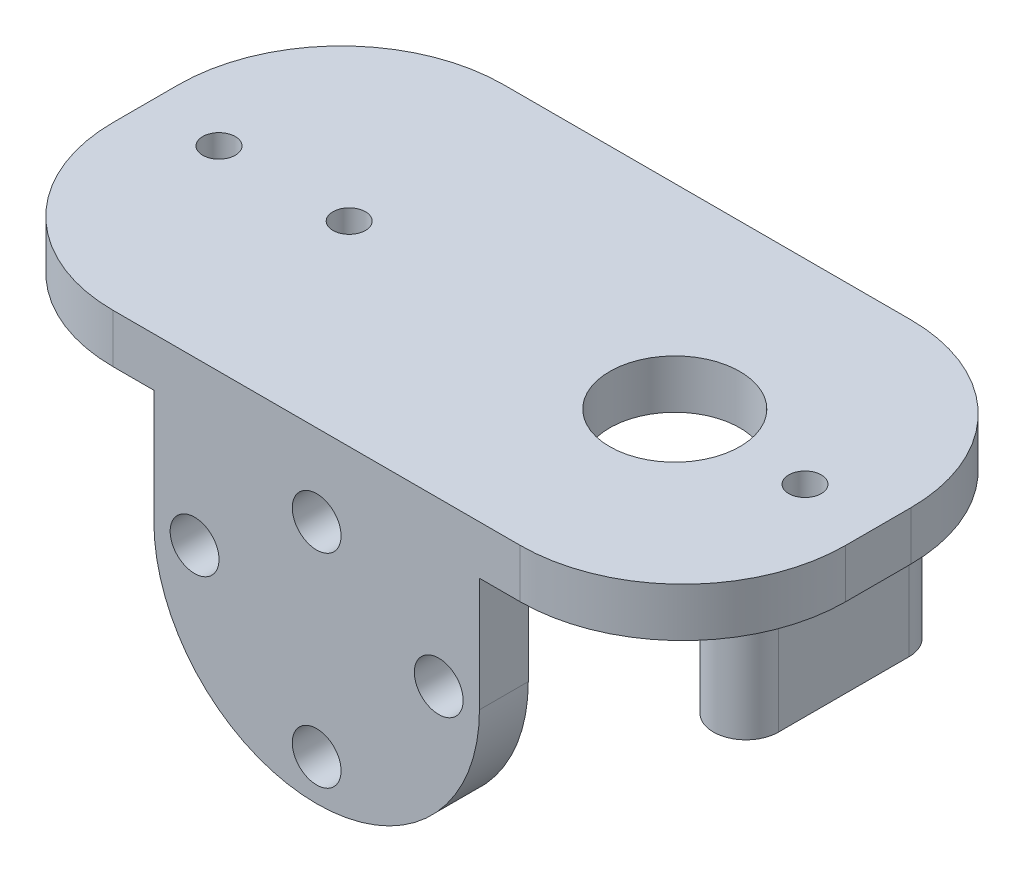
ISO-10303-21;
HEADER;
FILE_DESCRIPTION(('STEP AP214'),'2;1');
FILE_NAME('part.step','',(''),(''),'','','');
FILE_SCHEMA(('AUTOMOTIVE_DESIGN { 1 0 10303 214 1 1 1 1 }'));
ENDSEC;
DATA;
#1=APPLICATION_CONTEXT('core data for automotive mechanical design processes');
#2=APPLICATION_PROTOCOL_DEFINITION('international standard','automotive_design',2000,#1);
#3=PRODUCT_CONTEXT('',#1,'mechanical');
#4=PRODUCT('Part','Part','',(#3));
#5=PRODUCT_RELATED_PRODUCT_CATEGORY('part','',(#4));
#6=PRODUCT_DEFINITION_FORMATION('','',#4);
#7=PRODUCT_DEFINITION_CONTEXT('part definition',#1,'design');
#8=PRODUCT_DEFINITION('design','',#6,#7);
#9=PRODUCT_DEFINITION_SHAPE('','',#8);
#10=(LENGTH_UNIT() NAMED_UNIT(*) SI_UNIT(.MILLI.,.METRE.));
#11=(NAMED_UNIT(*) PLANE_ANGLE_UNIT() SI_UNIT($,.RADIAN.));
#12=(NAMED_UNIT(*) SI_UNIT($,.STERADIAN.) SOLID_ANGLE_UNIT());
#13=UNCERTAINTY_MEASURE_WITH_UNIT(LENGTH_MEASURE(1.E-05),#10,'distance_accuracy_value','');
#14=(GEOMETRIC_REPRESENTATION_CONTEXT(3) GLOBAL_UNCERTAINTY_ASSIGNED_CONTEXT((#13)) GLOBAL_UNIT_ASSIGNED_CONTEXT((#10,
#11,#12)) REPRESENTATION_CONTEXT('',''));
#15=CARTESIAN_POINT('',(0.,0.,0.));
#16=DIRECTION('',(0.,0.,1.));
#17=DIRECTION('',(1.,0.,0.));
#18=AXIS2_PLACEMENT_3D('',#15,#16,#17);
#19=CARTESIAN_POINT('',(0.,-2.,9.));
#20=DIRECTION('',(0.,0.,1.));
#21=DIRECTION('',(1.,0.,0.));
#22=AXIS2_PLACEMENT_3D('',#19,#20,#21);
#23=CYLINDRICAL_SURFACE('',#22,1.5);
#24=CARTESIAN_POINT('',(0.,-2.,12.));
#25=DIRECTION('',(0.,0.,1.));
#26=DIRECTION('',(1.,0.,0.));
#27=AXIS2_PLACEMENT_3D('',#24,#25,#26);
#28=CIRCLE('',#27,1.5);
#29=CARTESIAN_POINT('',(1.5,-2.,12.));
#30=VERTEX_POINT('',#29);
#31=EDGE_CURVE('E11',#30,#30,#28,.T.);
#32=ORIENTED_EDGE('',*,*,#31,.T.);
#33=EDGE_LOOP('',(#32));
#34=FACE_BOUND('',#33,.T.);
#35=CARTESIAN_POINT('',(0.,-2.,9.));
#36=DIRECTION('',(0.,0.,1.));
#37=DIRECTION('',(1.,0.,0.));
#38=AXIS2_PLACEMENT_3D('',#35,#36,#37);
#39=CIRCLE('',#38,1.5);
#40=CARTESIAN_POINT('',(1.5,-2.,9.));
#41=VERTEX_POINT('',#40);
#42=EDGE_CURVE('E340',#41,#41,#39,.T.);
#43=ORIENTED_EDGE('',*,*,#42,.F.);
#44=EDGE_LOOP('',(#43));
#45=FACE_BOUND('',#44,.T.);
#46=ADVANCED_FACE('F17',(#34,#45),#23,.F.);
#47=CARTESIAN_POINT('',(7.5,-7.,9.));
#48=DIRECTION('',(0.,0.,1.));
#49=DIRECTION('',(1.,0.,0.));
#50=AXIS2_PLACEMENT_3D('',#47,#48,#49);
#51=CYLINDRICAL_SURFACE('',#50,1.5);
#52=CARTESIAN_POINT('',(7.5,-7.,12.));
#53=DIRECTION('',(0.,0.,1.));
#54=DIRECTION('',(1.,0.,0.));
#55=AXIS2_PLACEMENT_3D('',#52,#53,#54);
#56=CIRCLE('',#55,1.5);
#57=CARTESIAN_POINT('',(9.00000000000001,-7.,12.));
#58=VERTEX_POINT('',#57);
#59=EDGE_CURVE('E27',#58,#58,#56,.T.);
#60=ORIENTED_EDGE('',*,*,#59,.T.);
#61=EDGE_LOOP('',(#60));
#62=FACE_BOUND('',#61,.T.);
#63=CARTESIAN_POINT('',(7.5,-7.,9.));
#64=DIRECTION('',(0.,0.,1.));
#65=DIRECTION('',(1.,0.,0.));
#66=AXIS2_PLACEMENT_3D('',#63,#64,#65);
#67=CIRCLE('',#66,1.5);
#68=CARTESIAN_POINT('',(9.00000000000001,-7.,9.));
#69=VERTEX_POINT('',#68);
#70=EDGE_CURVE('E817',#69,#69,#67,.T.);
#71=ORIENTED_EDGE('',*,*,#70,.F.);
#72=EDGE_LOOP('',(#71));
#73=FACE_BOUND('',#72,.T.);
#74=ADVANCED_FACE('F391',(#62,#73),#51,.F.);
#75=CARTESIAN_POINT('',(-7.5,-7.00000000000007,9.));
#76=DIRECTION('',(0.,0.,1.));
#77=DIRECTION('',(1.,0.,0.));
#78=AXIS2_PLACEMENT_3D('',#75,#76,#77);
#79=CYLINDRICAL_SURFACE('',#78,1.5);
#80=CARTESIAN_POINT('',(-7.5,-7.00000000000007,12.));
#81=DIRECTION('',(0.,0.,1.));
#82=DIRECTION('',(1.,0.,0.));
#83=AXIS2_PLACEMENT_3D('',#80,#81,#82);
#84=CIRCLE('',#83,1.5);
#85=CARTESIAN_POINT('',(-6.,-7.00000000000007,12.));
#86=VERTEX_POINT('',#85);
#87=EDGE_CURVE('E806',#86,#86,#84,.T.);
#88=ORIENTED_EDGE('',*,*,#87,.T.);
#89=EDGE_LOOP('',(#88));
#90=FACE_BOUND('',#89,.T.);
#91=CARTESIAN_POINT('',(-7.5,-7.00000000000007,9.));
#92=DIRECTION('',(0.,0.,1.));
#93=DIRECTION('',(1.,0.,0.));
#94=AXIS2_PLACEMENT_3D('',#91,#92,#93);
#95=CIRCLE('',#94,1.5);
#96=CARTESIAN_POINT('',(-6.,-7.00000000000007,9.));
#97=VERTEX_POINT('',#96);
#98=EDGE_CURVE('E812',#97,#97,#95,.T.);
#99=ORIENTED_EDGE('',*,*,#98,.F.);
#100=EDGE_LOOP('',(#99));
#101=FACE_BOUND('',#100,.T.);
#102=ADVANCED_FACE('F397',(#90,#101),#79,.F.);
#103=CARTESIAN_POINT('',(0.,-14.5,9.));
#104=DIRECTION('',(0.,0.,1.));
#105=DIRECTION('',(1.,0.,0.));
#106=AXIS2_PLACEMENT_3D('',#103,#104,#105);
#107=CYLINDRICAL_SURFACE('',#106,1.5);
#108=CARTESIAN_POINT('',(0.,-14.5,12.));
#109=DIRECTION('',(0.,0.,1.));
#110=DIRECTION('',(1.,0.,0.));
#111=AXIS2_PLACEMENT_3D('',#108,#109,#110);
#112=CIRCLE('',#111,1.5);
#113=CARTESIAN_POINT('',(1.5,-14.5,12.));
#114=VERTEX_POINT('',#113);
#115=EDGE_CURVE('E293',#114,#114,#112,.T.);
#116=ORIENTED_EDGE('',*,*,#115,.T.);
#117=EDGE_LOOP('',(#116));
#118=FACE_BOUND('',#117,.T.);
#119=CARTESIAN_POINT('',(0.,-14.5,9.));
#120=DIRECTION('',(0.,0.,1.));
#121=DIRECTION('',(1.,0.,0.));
#122=AXIS2_PLACEMENT_3D('',#119,#120,#121);
#123=CIRCLE('',#122,1.5);
#124=CARTESIAN_POINT('',(1.5,-14.5,9.));
#125=VERTEX_POINT('',#124);
#126=EDGE_CURVE('E168',#125,#125,#123,.T.);
#127=ORIENTED_EDGE('',*,*,#126,.F.);
#128=EDGE_LOOP('',(#127));
#129=FACE_BOUND('',#128,.T.);
#130=ADVANCED_FACE('F404',(#118,#129),#107,.F.);
#131=CARTESIAN_POINT('',(-9.24834793993413,-2.,-0.252193543203161));
#132=DIRECTION('',(0.,-1.,0.));
#133=DIRECTION('',(0.,0.,-1.));
#134=AXIS2_PLACEMENT_3D('',#131,#132,#133);
#135=CYLINDRICAL_SURFACE('',#134,1.);
#136=CARTESIAN_POINT('',(-9.24834793993413,-7.,-0.252193543203161));
#137=DIRECTION('',(0.,-1.,0.));
#138=DIRECTION('',(0.,0.,-1.));
#139=AXIS2_PLACEMENT_3D('',#136,#137,#138);
#140=CIRCLE('',#139,1.);
#141=CARTESIAN_POINT('',(-9.24834793993413,-7.,-1.25219354320316));
#142=VERTEX_POINT('',#141);
#143=EDGE_CURVE('E295',#142,#142,#140,.T.);
#144=ORIENTED_EDGE('',*,*,#143,.T.);
#145=EDGE_LOOP('',(#144));
#146=FACE_BOUND('',#145,.T.);
#147=CARTESIAN_POINT('',(-9.24834793993413,-2.,-0.252193543203161));
#148=DIRECTION('',(0.,-1.,0.));
#149=DIRECTION('',(0.,0.,-1.));
#150=AXIS2_PLACEMENT_3D('',#147,#148,#149);
#151=CIRCLE('',#150,1.);
#152=CARTESIAN_POINT('',(-9.24834793993413,-2.,-1.25219354320316));
#153=VERTEX_POINT('',#152);
#154=EDGE_CURVE('E283',#153,#153,#151,.T.);
#155=ORIENTED_EDGE('',*,*,#154,.F.);
#156=EDGE_LOOP('',(#155));
#157=FACE_BOUND('',#156,.T.);
#158=ADVANCED_FACE('F408',(#146,#157),#135,.F.);
#159=CARTESIAN_POINT('',(18.7492490636064,-2.,0.11463342872871));
#160=DIRECTION('',(0.,-1.,0.));
#161=DIRECTION('',(0.,0.,-1.));
#162=AXIS2_PLACEMENT_3D('',#159,#160,#161);
#163=CYLINDRICAL_SURFACE('',#162,1.);
#164=CARTESIAN_POINT('',(18.7492490636064,-7.,0.11463342872871));
#165=DIRECTION('',(0.,-1.,0.));
#166=DIRECTION('',(0.,0.,-1.));
#167=AXIS2_PLACEMENT_3D('',#164,#165,#166);
#168=CIRCLE('',#167,1.);
#169=CARTESIAN_POINT('',(18.7492490636064,-7.,-0.885366571271291));
#170=VERTEX_POINT('',#169);
#171=EDGE_CURVE('E297',#170,#170,#168,.T.);
#172=ORIENTED_EDGE('',*,*,#171,.T.);
#173=EDGE_LOOP('',(#172));
#174=FACE_BOUND('',#173,.T.);
#175=CARTESIAN_POINT('',(18.7492490636064,-2.,0.11463342872871));
#176=DIRECTION('',(0.,-1.,0.));
#177=DIRECTION('',(0.,0.,-1.));
#178=AXIS2_PLACEMENT_3D('',#175,#176,#177);
#179=CIRCLE('',#178,1.);
#180=CARTESIAN_POINT('',(18.7492490636064,-2.,-0.885366571271291));
#181=VERTEX_POINT('',#180);
#182=EDGE_CURVE('E281',#181,#181,#179,.T.);
#183=ORIENTED_EDGE('',*,*,#182,.F.);
#184=EDGE_LOOP('',(#183));
#185=FACE_BOUND('',#184,.T.);
#186=ADVANCED_FACE('F412',(#174,#185),#163,.F.);
#187=CARTESIAN_POINT('',(18.,0.,0.));
#188=DIRECTION('',(0.,1.,0.));
#189=DIRECTION('',(0.,0.,1.));
#190=AXIS2_PLACEMENT_3D('',#187,#188,#189);
#191=CYLINDRICAL_SURFACE('',#190,1.);
#192=CARTESIAN_POINT('',(18.,3.,0.));
#193=DIRECTION('',(0.,1.,0.));
#194=DIRECTION('',(0.,0.,1.));
#195=AXIS2_PLACEMENT_3D('',#192,#193,#194);
#196=CIRCLE('',#195,1.);
#197=CARTESIAN_POINT('',(18.,3.,1.));
#198=VERTEX_POINT('',#197);
#199=EDGE_CURVE('E301',#198,#198,#196,.T.);
#200=ORIENTED_EDGE('',*,*,#199,.T.);
#201=EDGE_LOOP('',(#200));
#202=FACE_BOUND('',#201,.T.);
#203=CARTESIAN_POINT('',(18.,0.,0.));
#204=DIRECTION('',(0.,1.,0.));
#205=DIRECTION('',(0.,0.,1.));
#206=AXIS2_PLACEMENT_3D('',#203,#204,#205);
#207=CIRCLE('',#206,1.);
#208=CARTESIAN_POINT('',(18.,0.,1.));
#209=VERTEX_POINT('',#208);
#210=EDGE_CURVE('E259',#209,#209,#207,.T.);
#211=ORIENTED_EDGE('',*,*,#210,.F.);
#212=EDGE_LOOP('',(#211));
#213=FACE_BOUND('',#212,.T.);
#214=ADVANCED_FACE('F416',(#202,#213),#191,.F.);
#215=CARTESIAN_POINT('',(-10.,0.,0.));
#216=DIRECTION('',(0.,1.,0.));
#217=DIRECTION('',(0.,0.,1.));
#218=AXIS2_PLACEMENT_3D('',#215,#216,#217);
#219=CYLINDRICAL_SURFACE('',#218,1.);
#220=CARTESIAN_POINT('',(-10.,3.,0.));
#221=DIRECTION('',(0.,1.,0.));
#222=DIRECTION('',(0.,0.,1.));
#223=AXIS2_PLACEMENT_3D('',#220,#221,#222);
#224=CIRCLE('',#223,1.);
#225=CARTESIAN_POINT('',(-10.,3.,1.));
#226=VERTEX_POINT('',#225);
#227=EDGE_CURVE('E306',#226,#226,#224,.T.);
#228=ORIENTED_EDGE('',*,*,#227,.T.);
#229=EDGE_LOOP('',(#228));
#230=FACE_BOUND('',#229,.T.);
#231=CARTESIAN_POINT('',(-10.,0.,0.));
#232=DIRECTION('',(0.,1.,0.));
#233=DIRECTION('',(0.,0.,1.));
#234=AXIS2_PLACEMENT_3D('',#231,#232,#233);
#235=CIRCLE('',#234,1.);
#236=CARTESIAN_POINT('',(-10.,0.,1.));
#237=VERTEX_POINT('',#236);
#238=EDGE_CURVE('E236',#237,#237,#235,.T.);
#239=ORIENTED_EDGE('',*,*,#238,.F.);
#240=EDGE_LOOP('',(#239));
#241=FACE_BOUND('',#240,.T.);
#242=ADVANCED_FACE('F420',(#230,#241),#219,.F.);
#243=CARTESIAN_POINT('',(-18.,0.,0.));
#244=DIRECTION('',(0.,1.,0.));
#245=DIRECTION('',(0.,0.,1.));
#246=AXIS2_PLACEMENT_3D('',#243,#244,#245);
#247=CYLINDRICAL_SURFACE('',#246,1.);
#248=CARTESIAN_POINT('',(-18.,3.,0.));
#249=DIRECTION('',(0.,1.,0.));
#250=DIRECTION('',(0.,0.,1.));
#251=AXIS2_PLACEMENT_3D('',#248,#249,#250);
#252=CIRCLE('',#251,1.);
#253=CARTESIAN_POINT('',(-18.,3.,1.));
#254=VERTEX_POINT('',#253);
#255=EDGE_CURVE('E311',#254,#254,#252,.T.);
#256=ORIENTED_EDGE('',*,*,#255,.T.);
#257=EDGE_LOOP('',(#256));
#258=FACE_BOUND('',#257,.T.);
#259=CARTESIAN_POINT('',(-18.,0.,0.));
#260=DIRECTION('',(0.,1.,0.));
#261=DIRECTION('',(0.,0.,1.));
#262=AXIS2_PLACEMENT_3D('',#259,#260,#261);
#263=CIRCLE('',#262,1.);
#264=CARTESIAN_POINT('',(-18.,0.,1.));
#265=VERTEX_POINT('',#264);
#266=EDGE_CURVE('E312',#265,#265,#263,.T.);
#267=ORIENTED_EDGE('',*,*,#266,.F.);
#268=EDGE_LOOP('',(#267));
#269=FACE_BOUND('',#268,.T.);
#270=ADVANCED_FACE('F424',(#258,#269),#247,.F.);
#271=CARTESIAN_POINT('',(10.,0.,0.));
#272=DIRECTION('',(0.,1.,0.));
#273=DIRECTION('',(0.,0.,1.));
#274=AXIS2_PLACEMENT_3D('',#271,#272,#273);
#275=CYLINDRICAL_SURFACE('',#274,4.);
#276=CARTESIAN_POINT('',(10.,3.,0.));
#277=DIRECTION('',(0.,1.,0.));
#278=DIRECTION('',(0.,0.,1.));
#279=AXIS2_PLACEMENT_3D('',#276,#277,#278);
#280=CIRCLE('',#279,4.);
#281=CARTESIAN_POINT('',(10.,3.,4.));
#282=VERTEX_POINT('',#281);
#283=EDGE_CURVE('E319',#282,#282,#280,.T.);
#284=ORIENTED_EDGE('',*,*,#283,.T.);
#285=EDGE_LOOP('',(#284));
#286=FACE_BOUND('',#285,.T.);
#287=CARTESIAN_POINT('',(10.,0.,0.));
#288=DIRECTION('',(0.,1.,0.));
#289=DIRECTION('',(0.,0.,1.));
#290=AXIS2_PLACEMENT_3D('',#287,#288,#289);
#291=CIRCLE('',#290,4.);
#292=CARTESIAN_POINT('',(10.,0.,4.));
#293=VERTEX_POINT('',#292);
#294=EDGE_CURVE('E315',#293,#293,#291,.T.);
#295=ORIENTED_EDGE('',*,*,#294,.F.);
#296=EDGE_LOOP('',(#295));
#297=FACE_BOUND('',#296,.T.);
#298=ADVANCED_FACE('F428',(#286,#297),#275,.F.);
#299=CARTESIAN_POINT('',(0.,0.,0.));
#300=DIRECTION('',(0.,1.,0.));
#301=DIRECTION('',(0.,0.,1.));
#302=AXIS2_PLACEMENT_3D('',#299,#300,#301);
#303=PLANE('',#302);
#304=CARTESIAN_POINT('',(18.3736323404437,0.,4.));
#305=DIRECTION('',(0.,1.,0.));
#306=DIRECTION('',(0.,0.,1.));
#307=AXIS2_PLACEMENT_3D('',#304,#305,#306);
#308=CIRCLE('',#307,2.);
#309=CARTESIAN_POINT('',(16.3736323404437,0.,4.));
#310=VERTEX_POINT('',#309);
#311=CARTESIAN_POINT('',(20.3736323404437,0.,4.));
#312=VERTEX_POINT('',#311);
#313=EDGE_CURVE('E36',#310,#312,#308,.T.);
#314=ORIENTED_EDGE('',*,*,#313,.T.);
#315=DIRECTION('',(0.,0.,1.));
#316=VECTOR('',#315,1.);
#317=CARTESIAN_POINT('',(20.3736323404437,0.,6.));
#318=LINE('',#317,#316);
#319=CARTESIAN_POINT('',(20.3736323404437,0.,-4.));
#320=VERTEX_POINT('',#319);
#321=EDGE_CURVE('E277',#320,#312,#318,.T.);
#322=ORIENTED_EDGE('',*,*,#321,.F.);
#323=CARTESIAN_POINT('',(18.3736323404437,0.,-4.));
#324=DIRECTION('',(0.,1.,0.));
#325=DIRECTION('',(0.,0.,1.));
#326=AXIS2_PLACEMENT_3D('',#323,#324,#325);
#327=CIRCLE('',#326,2.);
#328=CARTESIAN_POINT('',(16.3736323404437,0.,-4.));
#329=VERTEX_POINT('',#328);
#330=EDGE_CURVE('E322',#320,#329,#327,.T.);
#331=ORIENTED_EDGE('',*,*,#330,.T.);
#332=DIRECTION('',(0.,0.,-1.));
#333=VECTOR('',#332,1.);
#334=CARTESIAN_POINT('',(16.3736323404437,0.,6.));
#335=LINE('',#334,#333);
#336=EDGE_CURVE('E263',#310,#329,#335,.T.);
#337=ORIENTED_EDGE('',*,*,#336,.F.);
#338=EDGE_LOOP('',(#314,#322,#331,#337));
#339=FACE_BOUND('',#338,.T.);
#340=ORIENTED_EDGE('',*,*,#294,.T.);
#341=EDGE_LOOP('',(#340));
#342=FACE_BOUND('',#341,.T.);
#343=ORIENTED_EDGE('',*,*,#266,.T.);
#344=EDGE_LOOP('',(#343));
#345=FACE_BOUND('',#344,.T.);
#346=CARTESIAN_POINT('',(-9.12636765955629,0.,4.));
#347=DIRECTION('',(0.,1.,0.));
#348=DIRECTION('',(0.,0.,1.));
#349=AXIS2_PLACEMENT_3D('',#346,#347,#348);
#350=CIRCLE('',#349,2.);
#351=CARTESIAN_POINT('',(-11.1263676595563,0.,4.));
#352=VERTEX_POINT('',#351);
#353=CARTESIAN_POINT('',(-7.12636765955629,0.,4.));
#354=VERTEX_POINT('',#353);
#355=EDGE_CURVE('E316',#352,#354,#350,.T.);
#356=ORIENTED_EDGE('',*,*,#355,.T.);
#357=DIRECTION('',(0.,0.,1.));
#358=VECTOR('',#357,1.);
#359=CARTESIAN_POINT('',(-7.12636765955629,0.,6.));
#360=LINE('',#359,#358);
#361=CARTESIAN_POINT('',(-7.12636765955629,0.,-4.));
#362=VERTEX_POINT('',#361);
#363=EDGE_CURVE('E254',#362,#354,#360,.T.);
#364=ORIENTED_EDGE('',*,*,#363,.F.);
#365=CARTESIAN_POINT('',(-9.12636765955629,0.,-4.));
#366=DIRECTION('',(0.,1.,0.));
#367=DIRECTION('',(0.,0.,1.));
#368=AXIS2_PLACEMENT_3D('',#365,#366,#367);
#369=CIRCLE('',#368,2.);
#370=CARTESIAN_POINT('',(-11.1263676595563,0.,-4.));
#371=VERTEX_POINT('',#370);
#372=EDGE_CURVE('E331',#362,#371,#369,.T.);
#373=ORIENTED_EDGE('',*,*,#372,.T.);
#374=DIRECTION('',(0.,0.,-1.));
#375=VECTOR('',#374,1.);
#376=CARTESIAN_POINT('',(-11.1263676595563,0.,6.));
#377=LINE('',#376,#375);
#378=EDGE_CURVE('E240',#352,#371,#377,.T.);
#379=ORIENTED_EDGE('',*,*,#378,.F.);
#380=EDGE_LOOP('',(#356,#364,#373,#379));
#381=FACE_BOUND('',#380,.T.);
#382=DIRECTION('',(0.,0.,-1.));
#383=VECTOR('',#382,1.);
#384=CARTESIAN_POINT('',(-10.,0.,12.));
#385=LINE('',#384,#383);
#386=CARTESIAN_POINT('',(-10.,0.,12.));
#387=VERTEX_POINT('',#386);
#388=CARTESIAN_POINT('',(-10.,0.,9.00000000000001));
#389=VERTEX_POINT('',#388);
#390=EDGE_CURVE('E195',#387,#389,#385,.T.);
#391=ORIENTED_EDGE('',*,*,#390,.F.);
#392=DIRECTION('',(1.,0.,0.));
#393=VECTOR('',#392,1.);
#394=CARTESIAN_POINT('',(22.5,0.,12.));
#395=LINE('',#394,#393);
#396=CARTESIAN_POINT('',(-12.5,0.,12.));
#397=VERTEX_POINT('',#396);
#398=EDGE_CURVE('E208',#397,#387,#395,.T.);
#399=ORIENTED_EDGE('',*,*,#398,.F.);
#400=CARTESIAN_POINT('',(-12.5,0.,2.));
#401=DIRECTION('',(0.,-1.,0.));
#402=DIRECTION('',(0.,0.,1.));
#403=AXIS2_PLACEMENT_3D('',#400,#401,#402);
#404=CIRCLE('',#403,10.);
#405=CARTESIAN_POINT('',(-22.5,0.,2.));
#406=VERTEX_POINT('',#405);
#407=EDGE_CURVE('E335',#397,#406,#404,.T.);
#408=ORIENTED_EDGE('',*,*,#407,.T.);
#409=DIRECTION('',(0.,0.,1.));
#410=VECTOR('',#409,1.);
#411=CARTESIAN_POINT('',(-22.5,0.,12.));
#412=LINE('',#411,#410);
#413=CARTESIAN_POINT('',(-22.5,0.,-2.));
#414=VERTEX_POINT('',#413);
#415=EDGE_CURVE('E183',#414,#406,#412,.T.);
#416=ORIENTED_EDGE('',*,*,#415,.F.);
#417=CARTESIAN_POINT('',(-12.5,0.,-2.));
#418=DIRECTION('',(0.,-1.,0.));
#419=DIRECTION('',(0.,0.,1.));
#420=AXIS2_PLACEMENT_3D('',#417,#418,#419);
#421=CIRCLE('',#420,10.);
#422=CARTESIAN_POINT('',(-12.5,0.,-12.));
#423=VERTEX_POINT('',#422);
#424=EDGE_CURVE('E345',#414,#423,#421,.T.);
#425=ORIENTED_EDGE('',*,*,#424,.T.);
#426=DIRECTION('',(-1.,0.,0.));
#427=VECTOR('',#426,1.);
#428=CARTESIAN_POINT('',(22.5,0.,-12.));
#429=LINE('',#428,#427);
#430=CARTESIAN_POINT('',(12.5,0.,-12.));
#431=VERTEX_POINT('',#430);
#432=EDGE_CURVE('E219',#431,#423,#429,.T.);
#433=ORIENTED_EDGE('',*,*,#432,.F.);
#434=CARTESIAN_POINT('',(12.5,0.,-2.));
#435=DIRECTION('',(0.,-1.,0.));
#436=DIRECTION('',(0.,0.,1.));
#437=AXIS2_PLACEMENT_3D('',#434,#435,#436);
#438=CIRCLE('',#437,10.);
#439=CARTESIAN_POINT('',(22.5,0.,-2.));
#440=VERTEX_POINT('',#439);
#441=EDGE_CURVE('E350',#431,#440,#438,.T.);
#442=ORIENTED_EDGE('',*,*,#441,.T.);
#443=DIRECTION('',(0.,0.,-1.));
#444=VECTOR('',#443,1.);
#445=CARTESIAN_POINT('',(22.5,0.,12.));
#446=LINE('',#445,#444);
#447=CARTESIAN_POINT('',(22.5,0.,2.));
#448=VERTEX_POINT('',#447);
#449=EDGE_CURVE('E215',#448,#440,#446,.T.);
#450=ORIENTED_EDGE('',*,*,#449,.F.);
#451=CARTESIAN_POINT('',(12.5,0.,2.));
#452=DIRECTION('',(0.,-1.,0.));
#453=DIRECTION('',(0.,0.,1.));
#454=AXIS2_PLACEMENT_3D('',#451,#452,#453);
#455=CIRCLE('',#454,10.);
#456=CARTESIAN_POINT('',(12.5,0.,12.));
#457=VERTEX_POINT('',#456);
#458=EDGE_CURVE('E347',#448,#457,#455,.T.);
#459=ORIENTED_EDGE('',*,*,#458,.T.);
#460=DIRECTION('',(1.,0.,0.));
#461=VECTOR('',#460,1.);
#462=CARTESIAN_POINT('',(22.5,0.,12.));
#463=LINE('',#462,#461);
#464=CARTESIAN_POINT('',(10.,0.,12.));
#465=VERTEX_POINT('',#464);
#466=EDGE_CURVE('E198',#465,#457,#463,.T.);
#467=ORIENTED_EDGE('',*,*,#466,.F.);
#468=DIRECTION('',(0.,0.,1.));
#469=VECTOR('',#468,1.);
#470=CARTESIAN_POINT('',(10.,0.,12.));
#471=LINE('',#470,#469);
#472=CARTESIAN_POINT('',(10.,0.,9.00000000000001));
#473=VERTEX_POINT('',#472);
#474=EDGE_CURVE('E161',#473,#465,#471,.T.);
#475=ORIENTED_EDGE('',*,*,#474,.F.);
#476=DIRECTION('',(1.,0.,0.));
#477=VECTOR('',#476,1.);
#478=CARTESIAN_POINT('',(-10.,0.,9.00000000000001));
#479=LINE('',#478,#477);
#480=EDGE_CURVE('E158',#389,#473,#479,.T.);
#481=ORIENTED_EDGE('',*,*,#480,.F.);
#482=EDGE_LOOP('',(#391,#399,#408,#416,#425,#433,#442,#450,#459,#467,#475,#481));
#483=FACE_BOUND('',#482,.T.);
#484=ADVANCED_FACE('F363',(#339,#342,#345,#381,#483),#303,.F.);
#485=CARTESIAN_POINT('',(-22.5,3.,12.));
#486=DIRECTION('',(1.,0.,0.));
#487=DIRECTION('',(0.,0.,-1.));
#488=AXIS2_PLACEMENT_3D('',#485,#486,#487);
#489=PLANE('',#488);
#490=ORIENTED_EDGE('',*,*,#415,.T.);
#491=DIRECTION('',(0.,1.,0.));
#492=VECTOR('',#491,1.);
#493=CARTESIAN_POINT('',(-22.5,3.,2.));
#494=LINE('',#493,#492);
#495=CARTESIAN_POINT('',(-22.5,3.,2.));
#496=VERTEX_POINT('',#495);
#497=EDGE_CURVE('E180',#406,#496,#494,.T.);
#498=ORIENTED_EDGE('',*,*,#497,.T.);
#499=DIRECTION('',(0.,0.,1.));
#500=VECTOR('',#499,1.);
#501=CARTESIAN_POINT('',(-22.5,3.,12.));
#502=LINE('',#501,#500);
#503=CARTESIAN_POINT('',(-22.5,3.,-2.));
#504=VERTEX_POINT('',#503);
#505=EDGE_CURVE('E185',#504,#496,#502,.T.);
#506=ORIENTED_EDGE('',*,*,#505,.F.);
#507=DIRECTION('',(0.,-1.,0.));
#508=VECTOR('',#507,1.);
#509=CARTESIAN_POINT('',(-22.5,3.,-2.));
#510=LINE('',#509,#508);
#511=EDGE_CURVE('E184',#504,#414,#510,.T.);
#512=ORIENTED_EDGE('',*,*,#511,.T.);
#513=EDGE_LOOP('',(#490,#498,#506,#512));
#514=FACE_BOUND('',#513,.T.);
#515=ADVANCED_FACE('F435',(#514),#489,.F.);
#516=CARTESIAN_POINT('',(22.5,3.,12.));
#517=DIRECTION('',(0.,0.,-1.));
#518=DIRECTION('',(-1.,0.,0.));
#519=AXIS2_PLACEMENT_3D('',#516,#517,#518);
#520=PLANE('',#519);
#521=ORIENTED_EDGE('',*,*,#31,.F.);
#522=EDGE_LOOP('',(#521));
#523=FACE_BOUND('',#522,.T.);
#524=ORIENTED_EDGE('',*,*,#59,.F.);
#525=EDGE_LOOP('',(#524));
#526=FACE_BOUND('',#525,.T.);
#527=ORIENTED_EDGE('',*,*,#87,.F.);
#528=EDGE_LOOP('',(#527));
#529=FACE_BOUND('',#528,.T.);
#530=ORIENTED_EDGE('',*,*,#115,.F.);
#531=EDGE_LOOP('',(#530));
#532=FACE_BOUND('',#531,.T.);
#533=DIRECTION('',(0.,1.,0.));
#534=VECTOR('',#533,1.);
#535=CARTESIAN_POINT('',(-10.,-17.,12.));
#536=LINE('',#535,#534);
#537=CARTESIAN_POINT('',(-10.,-7.,12.));
#538=VERTEX_POINT('',#537);
#539=EDGE_CURVE('E192',#538,#387,#536,.T.);
#540=ORIENTED_EDGE('',*,*,#539,.F.);
#541=CARTESIAN_POINT('',(0.,-7.,12.));
#542=DIRECTION('',(0.,0.,1.));
#543=DIRECTION('',(-1.,0.,0.));
#544=AXIS2_PLACEMENT_3D('',#541,#542,#543);
#545=CIRCLE('',#544,10.);
#546=CARTESIAN_POINT('',(10.,-7.,12.));
#547=VERTEX_POINT('',#546);
#548=EDGE_CURVE('E191',#538,#547,#545,.T.);
#549=ORIENTED_EDGE('',*,*,#548,.T.);
#550=DIRECTION('',(0.,1.,0.));
#551=VECTOR('',#550,1.);
#552=CARTESIAN_POINT('',(10.,-17.,12.));
#553=LINE('',#552,#551);
#554=EDGE_CURVE('E174',#547,#465,#553,.T.);
#555=ORIENTED_EDGE('',*,*,#554,.T.);
#556=ORIENTED_EDGE('',*,*,#466,.T.);
#557=DIRECTION('',(0.,1.,0.));
#558=VECTOR('',#557,1.);
#559=CARTESIAN_POINT('',(12.5,3.,12.));
#560=LINE('',#559,#558);
#561=CARTESIAN_POINT('',(12.5,3.,12.));
#562=VERTEX_POINT('',#561);
#563=EDGE_CURVE('E199',#457,#562,#560,.T.);
#564=ORIENTED_EDGE('',*,*,#563,.T.);
#565=DIRECTION('',(1.,0.,0.));
#566=VECTOR('',#565,1.);
#567=CARTESIAN_POINT('',(22.5,3.,12.));
#568=LINE('',#567,#566);
#569=CARTESIAN_POINT('',(-12.5,3.,12.));
#570=VERTEX_POINT('',#569);
#571=EDGE_CURVE('E203',#570,#562,#568,.T.);
#572=ORIENTED_EDGE('',*,*,#571,.F.);
#573=DIRECTION('',(0.,-1.,0.));
#574=VECTOR('',#573,1.);
#575=CARTESIAN_POINT('',(-12.5,3.,12.));
#576=LINE('',#575,#574);
#577=EDGE_CURVE('E202',#570,#397,#576,.T.);
#578=ORIENTED_EDGE('',*,*,#577,.T.);
#579=ORIENTED_EDGE('',*,*,#398,.T.);
#580=EDGE_LOOP('',(#540,#549,#555,#556,#564,#572,#578,#579));
#581=FACE_BOUND('',#580,.T.);
#582=ADVANCED_FACE('F358',(#523,#526,#529,#532,#581),#520,.F.);
#583=CARTESIAN_POINT('',(22.5,3.,12.));
#584=DIRECTION('',(-1.,0.,0.));
#585=DIRECTION('',(0.,0.,1.));
#586=AXIS2_PLACEMENT_3D('',#583,#584,#585);
#587=PLANE('',#586);
#588=DIRECTION('',(0.,0.,-1.));
#589=VECTOR('',#588,1.);
#590=CARTESIAN_POINT('',(22.5,3.,12.));
#591=LINE('',#590,#589);
#592=CARTESIAN_POINT('',(22.5,3.,2.));
#593=VERTEX_POINT('',#592);
#594=CARTESIAN_POINT('',(22.5,3.,-2.));
#595=VERTEX_POINT('',#594);
#596=EDGE_CURVE('E209',#593,#595,#591,.T.);
#597=ORIENTED_EDGE('',*,*,#596,.F.);
#598=DIRECTION('',(0.,-1.,0.));
#599=VECTOR('',#598,1.);
#600=CARTESIAN_POINT('',(22.5,3.,2.));
#601=LINE('',#600,#599);
#602=EDGE_CURVE('E212',#593,#448,#601,.T.);
#603=ORIENTED_EDGE('',*,*,#602,.T.);
#604=ORIENTED_EDGE('',*,*,#449,.T.);
#605=DIRECTION('',(0.,1.,0.));
#606=VECTOR('',#605,1.);
#607=CARTESIAN_POINT('',(22.5,3.,-2.));
#608=LINE('',#607,#606);
#609=EDGE_CURVE('E216',#440,#595,#608,.T.);
#610=ORIENTED_EDGE('',*,*,#609,.T.);
#611=EDGE_LOOP('',(#597,#603,#604,#610));
#612=FACE_BOUND('',#611,.T.);
#613=ADVANCED_FACE('F441',(#612),#587,.F.);
#614=CARTESIAN_POINT('',(22.5,3.,-12.));
#615=DIRECTION('',(0.,0.,1.));
#616=DIRECTION('',(1.,0.,0.));
#617=AXIS2_PLACEMENT_3D('',#614,#615,#616);
#618=PLANE('',#617);
#619=ORIENTED_EDGE('',*,*,#432,.T.);
#620=DIRECTION('',(0.,1.,0.));
#621=VECTOR('',#620,1.);
#622=CARTESIAN_POINT('',(-12.5,3.,-12.));
#623=LINE('',#622,#621);
#624=CARTESIAN_POINT('',(-12.5,3.,-12.));
#625=VERTEX_POINT('',#624);
#626=EDGE_CURVE('E220',#423,#625,#623,.T.);
#627=ORIENTED_EDGE('',*,*,#626,.T.);
#628=DIRECTION('',(-1.,0.,0.));
#629=VECTOR('',#628,1.);
#630=CARTESIAN_POINT('',(22.5,3.,-12.));
#631=LINE('',#630,#629);
#632=CARTESIAN_POINT('',(12.5,3.,-12.));
#633=VERTEX_POINT('',#632);
#634=EDGE_CURVE('E223',#633,#625,#631,.T.);
#635=ORIENTED_EDGE('',*,*,#634,.F.);
#636=DIRECTION('',(0.,-1.,0.));
#637=VECTOR('',#636,1.);
#638=CARTESIAN_POINT('',(12.5,3.,-12.));
#639=LINE('',#638,#637);
#640=EDGE_CURVE('E187',#633,#431,#639,.T.);
#641=ORIENTED_EDGE('',*,*,#640,.T.);
#642=EDGE_LOOP('',(#619,#627,#635,#641));
#643=FACE_BOUND('',#642,.T.);
#644=ADVANCED_FACE('F445',(#643),#618,.F.);
#645=CARTESIAN_POINT('',(0.,3.,0.));
#646=DIRECTION('',(0.,1.,0.));
#647=DIRECTION('',(0.,0.,1.));
#648=AXIS2_PLACEMENT_3D('',#645,#646,#647);
#649=PLANE('',#648);
#650=ORIENTED_EDGE('',*,*,#199,.F.);
#651=EDGE_LOOP('',(#650));
#652=FACE_BOUND('',#651,.T.);
#653=ORIENTED_EDGE('',*,*,#227,.F.);
#654=EDGE_LOOP('',(#653));
#655=FACE_BOUND('',#654,.T.);
#656=ORIENTED_EDGE('',*,*,#255,.F.);
#657=EDGE_LOOP('',(#656));
#658=FACE_BOUND('',#657,.T.);
#659=ORIENTED_EDGE('',*,*,#283,.F.);
#660=EDGE_LOOP('',(#659));
#661=FACE_BOUND('',#660,.T.);
#662=ORIENTED_EDGE('',*,*,#505,.T.);
#663=CARTESIAN_POINT('',(-12.5,3.,2.));
#664=DIRECTION('',(0.,1.,0.));
#665=DIRECTION('',(0.,0.,1.));
#666=AXIS2_PLACEMENT_3D('',#663,#664,#665);
#667=CIRCLE('',#666,10.);
#668=EDGE_CURVE('E188',#496,#570,#667,.T.);
#669=ORIENTED_EDGE('',*,*,#668,.T.);
#670=ORIENTED_EDGE('',*,*,#571,.T.);
#671=CARTESIAN_POINT('',(12.5,3.,2.));
#672=DIRECTION('',(0.,1.,0.));
#673=DIRECTION('',(0.,0.,1.));
#674=AXIS2_PLACEMENT_3D('',#671,#672,#673);
#675=CIRCLE('',#674,10.);
#676=EDGE_CURVE('E205',#562,#593,#675,.T.);
#677=ORIENTED_EDGE('',*,*,#676,.T.);
#678=ORIENTED_EDGE('',*,*,#596,.T.);
#679=CARTESIAN_POINT('',(12.5,3.,-2.));
#680=DIRECTION('',(0.,1.,0.));
#681=DIRECTION('',(0.,0.,1.));
#682=AXIS2_PLACEMENT_3D('',#679,#680,#681);
#683=CIRCLE('',#682,10.);
#684=EDGE_CURVE('E211',#595,#633,#683,.T.);
#685=ORIENTED_EDGE('',*,*,#684,.T.);
#686=ORIENTED_EDGE('',*,*,#634,.T.);
#687=CARTESIAN_POINT('',(-12.5,3.,-2.));
#688=DIRECTION('',(0.,1.,0.));
#689=DIRECTION('',(0.,0.,1.));
#690=AXIS2_PLACEMENT_3D('',#687,#688,#689);
#691=CIRCLE('',#690,10.);
#692=EDGE_CURVE('E225',#625,#504,#691,.T.);
#693=ORIENTED_EDGE('',*,*,#692,.T.);
#694=EDGE_LOOP('',(#662,#669,#670,#677,#678,#685,#686,#693));
#695=FACE_BOUND('',#694,.T.);
#696=ADVANCED_FACE('F368',(#652,#655,#658,#661,#695),#649,.T.);
#697=CARTESIAN_POINT('',(0.,0.,0.));
#698=DIRECTION('',(0.,-1.,0.));
#699=DIRECTION('',(0.,0.,-1.));
#700=AXIS2_PLACEMENT_3D('',#697,#698,#699);
#701=PLANE('',#700);
#702=ORIENTED_EDGE('',*,*,#238,.T.);
#703=EDGE_LOOP('',(#702));
#704=FACE_BOUND('',#703,.T.);
#705=ADVANCED_FACE('F452',(#704),#701,.F.);
#706=CARTESIAN_POINT('',(-11.1263676595563,-7.,6.));
#707=DIRECTION('',(1.,0.,0.));
#708=DIRECTION('',(0.,0.,-1.));
#709=AXIS2_PLACEMENT_3D('',#706,#707,#708);
#710=PLANE('',#709);
#711=ORIENTED_EDGE('',*,*,#378,.T.);
#712=DIRECTION('',(0.,-1.,0.));
#713=VECTOR('',#712,1.);
#714=CARTESIAN_POINT('',(-11.1263676595563,-7.,-4.));
#715=LINE('',#714,#713);
#716=CARTESIAN_POINT('',(-11.1263676595563,-7.,-4.));
#717=VERTEX_POINT('',#716);
#718=EDGE_CURVE('E237',#371,#717,#715,.T.);
#719=ORIENTED_EDGE('',*,*,#718,.T.);
#720=DIRECTION('',(0.,0.,-1.));
#721=VECTOR('',#720,1.);
#722=CARTESIAN_POINT('',(-11.1263676595563,-7.,6.));
#723=LINE('',#722,#721);
#724=CARTESIAN_POINT('',(-11.1263676595563,-7.,4.));
#725=VERTEX_POINT('',#724);
#726=EDGE_CURVE('E242',#725,#717,#723,.T.);
#727=ORIENTED_EDGE('',*,*,#726,.F.);
#728=DIRECTION('',(0.,1.,0.));
#729=VECTOR('',#728,1.);
#730=CARTESIAN_POINT('',(-11.1263676595563,-7.,4.));
#731=LINE('',#730,#729);
#732=EDGE_CURVE('E241',#725,#352,#731,.T.);
#733=ORIENTED_EDGE('',*,*,#732,.T.);
#734=EDGE_LOOP('',(#711,#719,#727,#733));
#735=FACE_BOUND('',#734,.T.);
#736=ADVANCED_FACE('F456',(#735),#710,.F.);
#737=CARTESIAN_POINT('',(-7.12636765955629,-7.,6.));
#738=DIRECTION('',(-1.,0.,0.));
#739=DIRECTION('',(0.,0.,1.));
#740=AXIS2_PLACEMENT_3D('',#737,#738,#739);
#741=PLANE('',#740);
#742=DIRECTION('',(0.,0.,1.));
#743=VECTOR('',#742,1.);
#744=CARTESIAN_POINT('',(-7.12636765955629,-7.,6.));
#745=LINE('',#744,#743);
#746=CARTESIAN_POINT('',(-7.12636765955629,-7.,-4.));
#747=VERTEX_POINT('',#746);
#748=CARTESIAN_POINT('',(-7.12636765955629,-7.,4.));
#749=VERTEX_POINT('',#748);
#750=EDGE_CURVE('E249',#747,#749,#745,.T.);
#751=ORIENTED_EDGE('',*,*,#750,.F.);
#752=DIRECTION('',(0.,1.,0.));
#753=VECTOR('',#752,1.);
#754=CARTESIAN_POINT('',(-7.12636765955629,-7.,-4.));
#755=LINE('',#754,#753);
#756=EDGE_CURVE('E248',#747,#362,#755,.T.);
#757=ORIENTED_EDGE('',*,*,#756,.T.);
#758=ORIENTED_EDGE('',*,*,#363,.T.);
#759=DIRECTION('',(0.,-1.,0.));
#760=VECTOR('',#759,1.);
#761=CARTESIAN_POINT('',(-7.12636765955629,-7.,4.));
#762=LINE('',#761,#760);
#763=EDGE_CURVE('E244',#354,#749,#762,.T.);
#764=ORIENTED_EDGE('',*,*,#763,.T.);
#765=EDGE_LOOP('',(#751,#757,#758,#764));
#766=FACE_BOUND('',#765,.T.);
#767=ADVANCED_FACE('F460',(#766),#741,.F.);
#768=CARTESIAN_POINT('',(0.,-7.,0.));
#769=DIRECTION('',(0.,-1.,0.));
#770=DIRECTION('',(0.,0.,-1.));
#771=AXIS2_PLACEMENT_3D('',#768,#769,#770);
#772=PLANE('',#771);
#773=ORIENTED_EDGE('',*,*,#143,.F.);
#774=EDGE_LOOP('',(#773));
#775=FACE_BOUND('',#774,.T.);
#776=ORIENTED_EDGE('',*,*,#726,.T.);
#777=CARTESIAN_POINT('',(-9.12636765955629,-7.,-4.));
#778=DIRECTION('',(0.,-1.,0.));
#779=DIRECTION('',(0.,0.,-1.));
#780=AXIS2_PLACEMENT_3D('',#777,#778,#779);
#781=CIRCLE('',#780,2.);
#782=EDGE_CURVE('E245',#717,#747,#781,.T.);
#783=ORIENTED_EDGE('',*,*,#782,.T.);
#784=ORIENTED_EDGE('',*,*,#750,.T.);
#785=CARTESIAN_POINT('',(-9.12636765955629,-7.,4.));
#786=DIRECTION('',(0.,-1.,0.));
#787=DIRECTION('',(0.,0.,-1.));
#788=AXIS2_PLACEMENT_3D('',#785,#786,#787);
#789=CIRCLE('',#788,2.);
#790=EDGE_CURVE('E251',#749,#725,#789,.T.);
#791=ORIENTED_EDGE('',*,*,#790,.T.);
#792=EDGE_LOOP('',(#776,#783,#784,#791));
#793=FACE_BOUND('',#792,.T.);
#794=ADVANCED_FACE('F464',(#775,#793),#772,.T.);
#795=CARTESIAN_POINT('',(0.,0.,0.));
#796=DIRECTION('',(0.,-1.,0.));
#797=DIRECTION('',(0.,0.,-1.));
#798=AXIS2_PLACEMENT_3D('',#795,#796,#797);
#799=PLANE('',#798);
#800=ORIENTED_EDGE('',*,*,#210,.T.);
#801=EDGE_LOOP('',(#800));
#802=FACE_BOUND('',#801,.T.);
#803=ADVANCED_FACE('F468',(#802),#799,.F.);
#804=CARTESIAN_POINT('',(16.3736323404437,-7.,6.));
#805=DIRECTION('',(1.,0.,0.));
#806=DIRECTION('',(0.,0.,-1.));
#807=AXIS2_PLACEMENT_3D('',#804,#805,#806);
#808=PLANE('',#807);
#809=ORIENTED_EDGE('',*,*,#336,.T.);
#810=DIRECTION('',(0.,-1.,0.));
#811=VECTOR('',#810,1.);
#812=CARTESIAN_POINT('',(16.3736323404437,-7.,-4.));
#813=LINE('',#812,#811);
#814=CARTESIAN_POINT('',(16.3736323404437,-7.,-4.));
#815=VERTEX_POINT('',#814);
#816=EDGE_CURVE('E260',#329,#815,#813,.T.);
#817=ORIENTED_EDGE('',*,*,#816,.T.);
#818=DIRECTION('',(0.,0.,-1.));
#819=VECTOR('',#818,1.);
#820=CARTESIAN_POINT('',(16.3736323404437,-7.,6.));
#821=LINE('',#820,#819);
#822=CARTESIAN_POINT('',(16.3736323404437,-7.,4.));
#823=VERTEX_POINT('',#822);
#824=EDGE_CURVE('E265',#823,#815,#821,.T.);
#825=ORIENTED_EDGE('',*,*,#824,.F.);
#826=DIRECTION('',(0.,1.,0.));
#827=VECTOR('',#826,1.);
#828=CARTESIAN_POINT('',(16.3736323404437,-7.,4.));
#829=LINE('',#828,#827);
#830=EDGE_CURVE('E264',#823,#310,#829,.T.);
#831=ORIENTED_EDGE('',*,*,#830,.T.);
#832=EDGE_LOOP('',(#809,#817,#825,#831));
#833=FACE_BOUND('',#832,.T.);
#834=ADVANCED_FACE('F472',(#833),#808,.F.);
#835=CARTESIAN_POINT('',(20.3736323404437,-7.,6.));
#836=DIRECTION('',(-1.,0.,0.));
#837=DIRECTION('',(0.,0.,1.));
#838=AXIS2_PLACEMENT_3D('',#835,#836,#837);
#839=PLANE('',#838);
#840=DIRECTION('',(0.,0.,1.));
#841=VECTOR('',#840,1.);
#842=CARTESIAN_POINT('',(20.3736323404437,-7.,6.));
#843=LINE('',#842,#841);
#844=CARTESIAN_POINT('',(20.3736323404437,-7.,-4.));
#845=VERTEX_POINT('',#844);
#846=CARTESIAN_POINT('',(20.3736323404437,-7.,4.));
#847=VERTEX_POINT('',#846);
#848=EDGE_CURVE('E272',#845,#847,#843,.T.);
#849=ORIENTED_EDGE('',*,*,#848,.F.);
#850=DIRECTION('',(0.,1.,0.));
#851=VECTOR('',#850,1.);
#852=CARTESIAN_POINT('',(20.3736323404437,-7.,-4.));
#853=LINE('',#852,#851);
#854=EDGE_CURVE('E271',#845,#320,#853,.T.);
#855=ORIENTED_EDGE('',*,*,#854,.T.);
#856=ORIENTED_EDGE('',*,*,#321,.T.);
#857=DIRECTION('',(0.,-1.,0.));
#858=VECTOR('',#857,1.);
#859=CARTESIAN_POINT('',(20.3736323404437,-7.,4.));
#860=LINE('',#859,#858);
#861=EDGE_CURVE('E267',#312,#847,#860,.T.);
#862=ORIENTED_EDGE('',*,*,#861,.T.);
#863=EDGE_LOOP('',(#849,#855,#856,#862));
#864=FACE_BOUND('',#863,.T.);
#865=ADVANCED_FACE('F476',(#864),#839,.F.);
#866=CARTESIAN_POINT('',(0.,-7.,0.));
#867=DIRECTION('',(0.,-1.,0.));
#868=DIRECTION('',(0.,0.,-1.));
#869=AXIS2_PLACEMENT_3D('',#866,#867,#868);
#870=PLANE('',#869);
#871=ORIENTED_EDGE('',*,*,#171,.F.);
#872=EDGE_LOOP('',(#871));
#873=FACE_BOUND('',#872,.T.);
#874=ORIENTED_EDGE('',*,*,#824,.T.);
#875=CARTESIAN_POINT('',(18.3736323404437,-7.,-4.));
#876=DIRECTION('',(0.,-1.,0.));
#877=DIRECTION('',(0.,0.,-1.));
#878=AXIS2_PLACEMENT_3D('',#875,#876,#877);
#879=CIRCLE('',#878,2.);
#880=EDGE_CURVE('E268',#815,#845,#879,.T.);
#881=ORIENTED_EDGE('',*,*,#880,.T.);
#882=ORIENTED_EDGE('',*,*,#848,.T.);
#883=CARTESIAN_POINT('',(18.3736323404437,-7.,4.));
#884=DIRECTION('',(0.,-1.,0.));
#885=DIRECTION('',(0.,0.,-1.));
#886=AXIS2_PLACEMENT_3D('',#883,#884,#885);
#887=CIRCLE('',#886,2.);
#888=EDGE_CURVE('E274',#847,#823,#887,.T.);
#889=ORIENTED_EDGE('',*,*,#888,.T.);
#890=EDGE_LOOP('',(#874,#881,#882,#889));
#891=FACE_BOUND('',#890,.T.);
#892=ADVANCED_FACE('F480',(#873,#891),#870,.T.);
#893=CARTESIAN_POINT('',(18.7492490636064,-2.,0.11463342872871));
#894=DIRECTION('',(0.,-1.,0.));
#895=DIRECTION('',(0.,0.,-1.));
#896=AXIS2_PLACEMENT_3D('',#893,#894,#895);
#897=PLANE('',#896);
#898=ORIENTED_EDGE('',*,*,#182,.T.);
#899=EDGE_LOOP('',(#898));
#900=FACE_BOUND('',#899,.T.);
#901=ADVANCED_FACE('F484',(#900),#897,.T.);
#902=CARTESIAN_POINT('',(-9.24834793993413,-2.,-0.252193543203161));
#903=DIRECTION('',(0.,-1.,0.));
#904=DIRECTION('',(0.,0.,-1.));
#905=AXIS2_PLACEMENT_3D('',#902,#903,#904);
#906=PLANE('',#905);
#907=ORIENTED_EDGE('',*,*,#154,.T.);
#908=EDGE_LOOP('',(#907));
#909=FACE_BOUND('',#908,.T.);
#910=ADVANCED_FACE('F488',(#909),#906,.T.);
#911=CARTESIAN_POINT('',(18.3736323404437,-7.,-4.));
#912=DIRECTION('',(0.,1.,0.));
#913=DIRECTION('',(0.,0.,1.));
#914=AXIS2_PLACEMENT_3D('',#911,#912,#913);
#915=CYLINDRICAL_SURFACE('',#914,2.);
#916=ORIENTED_EDGE('',*,*,#854,.F.);
#917=ORIENTED_EDGE('',*,*,#880,.F.);
#918=ORIENTED_EDGE('',*,*,#816,.F.);
#919=ORIENTED_EDGE('',*,*,#330,.F.);
#920=EDGE_LOOP('',(#916,#917,#918,#919));
#921=FACE_BOUND('',#920,.T.);
#922=ADVANCED_FACE('F492',(#921),#915,.T.);
#923=CARTESIAN_POINT('',(-9.12636765955629,-7.,-4.));
#924=DIRECTION('',(0.,1.,0.));
#925=DIRECTION('',(0.,0.,1.));
#926=AXIS2_PLACEMENT_3D('',#923,#924,#925);
#927=CYLINDRICAL_SURFACE('',#926,2.);
#928=ORIENTED_EDGE('',*,*,#756,.F.);
#929=ORIENTED_EDGE('',*,*,#782,.F.);
#930=ORIENTED_EDGE('',*,*,#718,.F.);
#931=ORIENTED_EDGE('',*,*,#372,.F.);
#932=EDGE_LOOP('',(#928,#929,#930,#931));
#933=FACE_BOUND('',#932,.T.);
#934=ADVANCED_FACE('F495',(#933),#927,.T.);
#935=CARTESIAN_POINT('',(-9.12636765955629,-7.,4.));
#936=DIRECTION('',(0.,1.,0.));
#937=DIRECTION('',(0.,0.,1.));
#938=AXIS2_PLACEMENT_3D('',#935,#936,#937);
#939=CYLINDRICAL_SURFACE('',#938,2.);
#940=ORIENTED_EDGE('',*,*,#763,.F.);
#941=ORIENTED_EDGE('',*,*,#355,.F.);
#942=ORIENTED_EDGE('',*,*,#732,.F.);
#943=ORIENTED_EDGE('',*,*,#790,.F.);
#944=EDGE_LOOP('',(#940,#941,#942,#943));
#945=FACE_BOUND('',#944,.T.);
#946=ADVANCED_FACE('F499',(#945),#939,.T.);
#947=CARTESIAN_POINT('',(18.3736323404437,-7.,4.));
#948=DIRECTION('',(0.,1.,0.));
#949=DIRECTION('',(0.,0.,1.));
#950=AXIS2_PLACEMENT_3D('',#947,#948,#949);
#951=CYLINDRICAL_SURFACE('',#950,2.);
#952=ORIENTED_EDGE('',*,*,#861,.F.);
#953=ORIENTED_EDGE('',*,*,#313,.F.);
#954=ORIENTED_EDGE('',*,*,#830,.F.);
#955=ORIENTED_EDGE('',*,*,#888,.F.);
#956=EDGE_LOOP('',(#952,#953,#954,#955));
#957=FACE_BOUND('',#956,.T.);
#958=ADVANCED_FACE('F503',(#957),#951,.T.);
#959=CARTESIAN_POINT('',(-12.5,3.,2.));
#960=DIRECTION('',(0.,-1.,0.));
#961=DIRECTION('',(0.,0.,-1.));
#962=AXIS2_PLACEMENT_3D('',#959,#960,#961);
#963=CYLINDRICAL_SURFACE('',#962,10.);
#964=ORIENTED_EDGE('',*,*,#668,.F.);
#965=ORIENTED_EDGE('',*,*,#497,.F.);
#966=ORIENTED_EDGE('',*,*,#407,.F.);
#967=ORIENTED_EDGE('',*,*,#577,.F.);
#968=EDGE_LOOP('',(#964,#965,#966,#967));
#969=FACE_BOUND('',#968,.T.);
#970=ADVANCED_FACE('F373',(#969),#963,.T.);
#971=CARTESIAN_POINT('',(12.5,3.,2.));
#972=DIRECTION('',(0.,-1.,0.));
#973=DIRECTION('',(0.,0.,-1.));
#974=AXIS2_PLACEMENT_3D('',#971,#972,#973);
#975=CYLINDRICAL_SURFACE('',#974,10.);
#976=ORIENTED_EDGE('',*,*,#676,.F.);
#977=ORIENTED_EDGE('',*,*,#563,.F.);
#978=ORIENTED_EDGE('',*,*,#458,.F.);
#979=ORIENTED_EDGE('',*,*,#602,.F.);
#980=EDGE_LOOP('',(#976,#977,#978,#979));
#981=FACE_BOUND('',#980,.T.);
#982=ADVANCED_FACE('F366',(#981),#975,.T.);
#983=CARTESIAN_POINT('',(-12.5,3.,-2.));
#984=DIRECTION('',(0.,-1.,0.));
#985=DIRECTION('',(0.,0.,-1.));
#986=AXIS2_PLACEMENT_3D('',#983,#984,#985);
#987=CYLINDRICAL_SURFACE('',#986,10.);
#988=ORIENTED_EDGE('',*,*,#692,.F.);
#989=ORIENTED_EDGE('',*,*,#626,.F.);
#990=ORIENTED_EDGE('',*,*,#424,.F.);
#991=ORIENTED_EDGE('',*,*,#511,.F.);
#992=EDGE_LOOP('',(#988,#989,#990,#991));
#993=FACE_BOUND('',#992,.T.);
#994=ADVANCED_FACE('F387',(#993),#987,.T.);
#995=CARTESIAN_POINT('',(12.5,3.,-2.));
#996=DIRECTION('',(0.,-1.,0.));
#997=DIRECTION('',(0.,0.,-1.));
#998=AXIS2_PLACEMENT_3D('',#995,#996,#997);
#999=CYLINDRICAL_SURFACE('',#998,10.);
#1000=ORIENTED_EDGE('',*,*,#684,.F.);
#1001=ORIENTED_EDGE('',*,*,#609,.F.);
#1002=ORIENTED_EDGE('',*,*,#441,.F.);
#1003=ORIENTED_EDGE('',*,*,#640,.F.);
#1004=EDGE_LOOP('',(#1000,#1001,#1002,#1003));
#1005=FACE_BOUND('',#1004,.T.);
#1006=ADVANCED_FACE('F378',(#1005),#999,.T.);
#1007=CARTESIAN_POINT('',(-10.,-17.,12.));
#1008=DIRECTION('',(1.,0.,0.));
#1009=DIRECTION('',(0.,0.,-1.));
#1010=AXIS2_PLACEMENT_3D('',#1007,#1008,#1009);
#1011=PLANE('',#1010);
#1012=DIRECTION('',(0.,1.,0.));
#1013=VECTOR('',#1012,1.);
#1014=CARTESIAN_POINT('',(-10.,-17.,9.00000000000001));
#1015=LINE('',#1014,#1013);
#1016=CARTESIAN_POINT('',(-10.,-7.,9.00000000000001));
#1017=VERTEX_POINT('',#1016);
#1018=EDGE_CURVE('E169',#1017,#389,#1015,.T.);
#1019=ORIENTED_EDGE('',*,*,#1018,.F.);
#1020=DIRECTION('',(0.,0.,1.));
#1021=VECTOR('',#1020,1.);
#1022=CARTESIAN_POINT('',(-10.,-7.,12.));
#1023=LINE('',#1022,#1021);
#1024=EDGE_CURVE('E167',#1017,#538,#1023,.T.);
#1025=ORIENTED_EDGE('',*,*,#1024,.T.);
#1026=ORIENTED_EDGE('',*,*,#539,.T.);
#1027=ORIENTED_EDGE('',*,*,#390,.T.);
#1028=EDGE_LOOP('',(#1019,#1025,#1026,#1027));
#1029=FACE_BOUND('',#1028,.T.);
#1030=ADVANCED_FACE('F376',(#1029),#1011,.F.);
#1031=CARTESIAN_POINT('',(-10.,-17.,9.00000000000001));
#1032=DIRECTION('',(0.,0.,1.));
#1033=DIRECTION('',(1.,0.,0.));
#1034=AXIS2_PLACEMENT_3D('',#1031,#1032,#1033);
#1035=PLANE('',#1034);
#1036=ORIENTED_EDGE('',*,*,#42,.T.);
#1037=EDGE_LOOP('',(#1036));
#1038=FACE_BOUND('',#1037,.T.);
#1039=ORIENTED_EDGE('',*,*,#70,.T.);
#1040=EDGE_LOOP('',(#1039));
#1041=FACE_BOUND('',#1040,.T.);
#1042=ORIENTED_EDGE('',*,*,#98,.T.);
#1043=EDGE_LOOP('',(#1042));
#1044=FACE_BOUND('',#1043,.T.);
#1045=ORIENTED_EDGE('',*,*,#126,.T.);
#1046=EDGE_LOOP('',(#1045));
#1047=FACE_BOUND('',#1046,.T.);
#1048=CARTESIAN_POINT('',(0.,-7.,9.00000000000001));
#1049=DIRECTION('',(0.,0.,-1.));
#1050=DIRECTION('',(1.,0.,0.));
#1051=AXIS2_PLACEMENT_3D('',#1048,#1049,#1050);
#1052=CIRCLE('',#1051,10.);
#1053=CARTESIAN_POINT('',(10.,-7.,9.00000000000001));
#1054=VERTEX_POINT('',#1053);
#1055=EDGE_CURVE('E152',#1054,#1017,#1052,.T.);
#1056=ORIENTED_EDGE('',*,*,#1055,.T.);
#1057=ORIENTED_EDGE('',*,*,#1018,.T.);
#1058=ORIENTED_EDGE('',*,*,#480,.T.);
#1059=DIRECTION('',(0.,1.,0.));
#1060=VECTOR('',#1059,1.);
#1061=CARTESIAN_POINT('',(10.,-17.,9.00000000000001));
#1062=LINE('',#1061,#1060);
#1063=EDGE_CURVE('E156',#1054,#473,#1062,.T.);
#1064=ORIENTED_EDGE('',*,*,#1063,.F.);
#1065=EDGE_LOOP('',(#1056,#1057,#1058,#1064));
#1066=FACE_BOUND('',#1065,.T.);
#1067=ADVANCED_FACE('F157',(#1038,#1041,#1044,#1047,#1066),#1035,.F.);
#1068=CARTESIAN_POINT('',(10.,-17.,12.));
#1069=DIRECTION('',(-1.,0.,0.));
#1070=DIRECTION('',(0.,0.,1.));
#1071=AXIS2_PLACEMENT_3D('',#1068,#1069,#1070);
#1072=PLANE('',#1071);
#1073=ORIENTED_EDGE('',*,*,#554,.F.);
#1074=DIRECTION('',(0.,0.,-1.));
#1075=VECTOR('',#1074,1.);
#1076=CARTESIAN_POINT('',(10.,-7.,9.00000000000001));
#1077=LINE('',#1076,#1075);
#1078=EDGE_CURVE('E21',#547,#1054,#1077,.T.);
#1079=ORIENTED_EDGE('',*,*,#1078,.T.);
#1080=ORIENTED_EDGE('',*,*,#1063,.T.);
#1081=ORIENTED_EDGE('',*,*,#474,.T.);
#1082=EDGE_LOOP('',(#1073,#1079,#1080,#1081));
#1083=FACE_BOUND('',#1082,.T.);
#1084=ADVANCED_FACE('F172',(#1083),#1072,.F.);
#1085=CARTESIAN_POINT('',(0.,-7.,0.));
#1086=DIRECTION('',(0.,0.,-1.));
#1087=DIRECTION('',(-1.,0.,0.));
#1088=AXIS2_PLACEMENT_3D('',#1085,#1086,#1087);
#1089=CYLINDRICAL_SURFACE('',#1088,10.);
#1090=ORIENTED_EDGE('',*,*,#1078,.F.);
#1091=ORIENTED_EDGE('',*,*,#548,.F.);
#1092=ORIENTED_EDGE('',*,*,#1024,.F.);
#1093=ORIENTED_EDGE('',*,*,#1055,.F.);
#1094=EDGE_LOOP('',(#1090,#1091,#1092,#1093));
#1095=FACE_BOUND('',#1094,.T.);
#1096=ADVANCED_FACE('F19',(#1095),#1089,.T.);
#1097=CLOSED_SHELL('',(#46,#74,#102,#130,#158,#186,#214,#242,#270,#298,#484,#515,#582,#613,#644,
#696,#705,#736,#767,#794,#803,#834,#865,#892,#901,#910,#922,#934,#946,#958,#970,#982,#994,#1006,
#1030,#1067,#1084,#1096));
#1098=MANIFOLD_SOLID_BREP('B1',#1097);
#1099=ADVANCED_BREP_SHAPE_REPRESENTATION('',(#18,#1098),#14);
#1100=SHAPE_DEFINITION_REPRESENTATION(#9,#1099);
ENDSEC;
END-ISO-10303-21;
